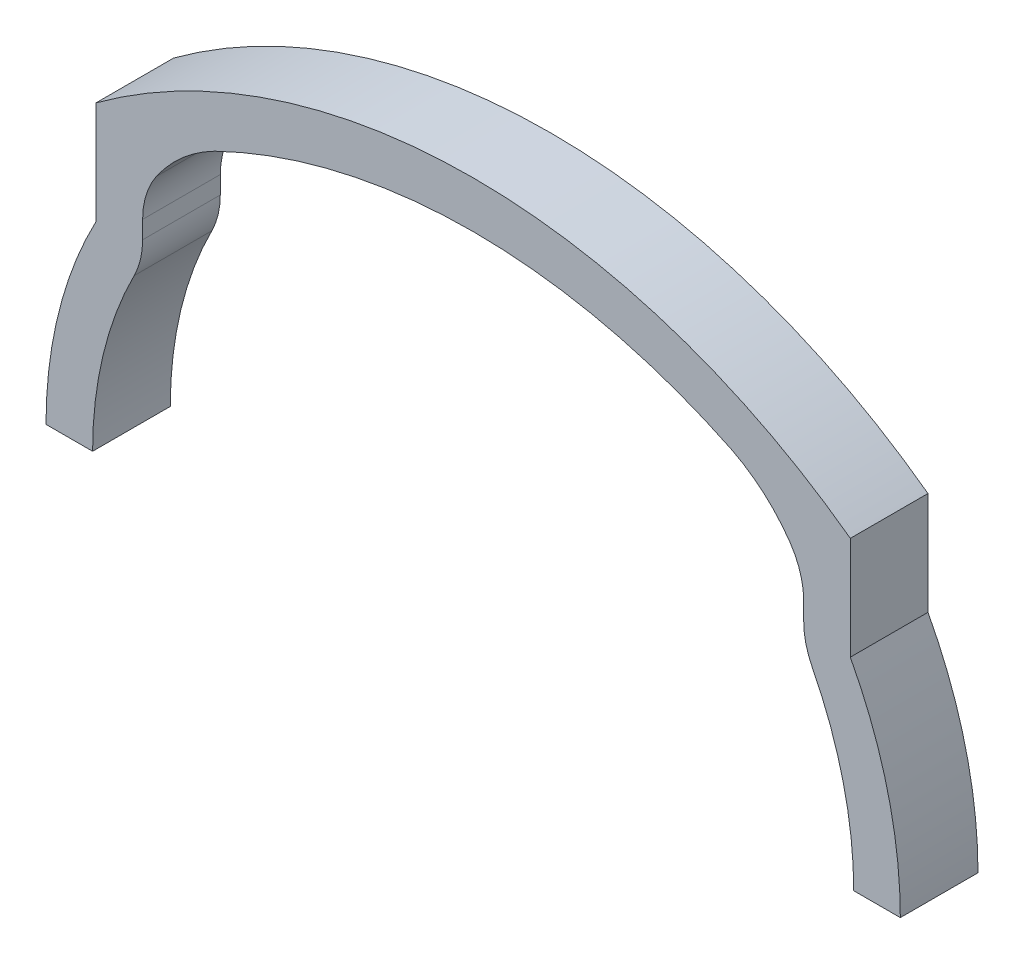
ISO-10303-21;
HEADER;
FILE_DESCRIPTION(('STEP AP214'),'2;1');
FILE_NAME('part.step','',(''),(''),'','','');
FILE_SCHEMA(('AUTOMOTIVE_DESIGN { 1 0 10303 214 1 1 1 1 }'));
ENDSEC;
DATA;
#1=APPLICATION_CONTEXT('core data for automotive mechanical design processes');
#2=APPLICATION_PROTOCOL_DEFINITION('international standard','automotive_design',2000,#1);
#3=PRODUCT_CONTEXT('',#1,'mechanical');
#4=PRODUCT('Part','Part','',(#3));
#5=PRODUCT_RELATED_PRODUCT_CATEGORY('part','',(#4));
#6=PRODUCT_DEFINITION_FORMATION('','',#4);
#7=PRODUCT_DEFINITION_CONTEXT('part definition',#1,'design');
#8=PRODUCT_DEFINITION('design','',#6,#7);
#9=PRODUCT_DEFINITION_SHAPE('','',#8);
#10=(LENGTH_UNIT() NAMED_UNIT(*) SI_UNIT(.MILLI.,.METRE.));
#11=(NAMED_UNIT(*) PLANE_ANGLE_UNIT() SI_UNIT($,.RADIAN.));
#12=(NAMED_UNIT(*) SI_UNIT($,.STERADIAN.) SOLID_ANGLE_UNIT());
#13=UNCERTAINTY_MEASURE_WITH_UNIT(LENGTH_MEASURE(1.E-05),#10,'distance_accuracy_value','');
#14=(GEOMETRIC_REPRESENTATION_CONTEXT(3) GLOBAL_UNCERTAINTY_ASSIGNED_CONTEXT((#13)) GLOBAL_UNIT_ASSIGNED_CONTEXT((#10,
#11,#12)) REPRESENTATION_CONTEXT('',''));
#15=CARTESIAN_POINT('',(0.,0.,0.));
#16=DIRECTION('',(0.,0.,1.));
#17=DIRECTION('',(1.,0.,0.));
#18=AXIS2_PLACEMENT_3D('',#15,#16,#17);
#19=CARTESIAN_POINT('',(-16.28,14.5401270485188,5.));
#20=DIRECTION('',(0.,0.,-1.));
#21=DIRECTION('',(-1.,0.,0.));
#22=AXIS2_PLACEMENT_3D('',#19,#20,#21);
#23=CYLINDRICAL_SURFACE('',#22,5.);
#24=CARTESIAN_POINT('',(-16.28,14.5401270485188,0.));
#25=DIRECTION('',(0.,0.,1.));
#26=DIRECTION('',(1.,0.,0.));
#27=AXIS2_PLACEMENT_3D('',#24,#25,#26);
#28=CIRCLE('',#27,5.);
#29=CARTESIAN_POINT('',(-20.3927555649448,17.3835829850537,0.));
#30=VERTEX_POINT('',#29);
#31=CARTESIAN_POINT('',(-21.28,14.5401270485188,0.));
#32=VERTEX_POINT('',#31);
#33=EDGE_CURVE('E198',#30,#32,#28,.T.);
#34=ORIENTED_EDGE('',*,*,#33,.F.);
#35=DIRECTION('',(0.,0.,-1.));
#36=VECTOR('',#35,1.);
#37=CARTESIAN_POINT('',(-20.3927555649448,17.3835829850537,5.));
#38=LINE('',#37,#36);
#39=CARTESIAN_POINT('',(-20.3927555649448,17.3835829850537,5.));
#40=VERTEX_POINT('',#39);
#41=EDGE_CURVE('E11',#40,#30,#38,.T.);
#42=ORIENTED_EDGE('',*,*,#41,.F.);
#43=CARTESIAN_POINT('',(-16.28,14.5401270485188,5.));
#44=DIRECTION('',(0.,0.,1.));
#45=DIRECTION('',(1.,0.,0.));
#46=AXIS2_PLACEMENT_3D('',#43,#44,#45);
#47=CIRCLE('',#46,5.);
#48=CARTESIAN_POINT('',(-21.28,14.5401270485188,5.));
#49=VERTEX_POINT('',#48);
#50=EDGE_CURVE('E256',#40,#49,#47,.T.);
#51=ORIENTED_EDGE('',*,*,#50,.T.);
#52=DIRECTION('',(0.,0.,-1.));
#53=VECTOR('',#52,1.);
#54=CARTESIAN_POINT('',(-21.28,14.5401270485188,5.));
#55=LINE('',#54,#53);
#56=EDGE_CURVE('E58',#49,#32,#55,.T.);
#57=ORIENTED_EDGE('',*,*,#56,.T.);
#58=EDGE_LOOP('',(#34,#42,#51,#57));
#59=FACE_BOUND('',#58,.T.);
#60=ADVANCED_FACE('F41',(#59),#23,.F.);
#61=CARTESIAN_POINT('',(-12.0318407884017,11.6030564303366,5.));
#62=DIRECTION('',(0.,0.,-1.));
#63=DIRECTION('',(-1.,0.,0.));
#64=AXIS2_PLACEMENT_3D('',#61,#62,#63);
#65=CYLINDRICAL_SURFACE('',#64,10.1646142647129);
#66=CARTESIAN_POINT('',(-12.0318407884017,11.6030564303366,0.));
#67=DIRECTION('',(0.,0.,1.));
#68=DIRECTION('',(1.,0.,0.));
#69=AXIS2_PLACEMENT_3D('',#66,#67,#68);
#70=CIRCLE('',#69,10.1646142647129);
#71=CARTESIAN_POINT('',(-16.6443577408908,20.660874628634,0.));
#72=VERTEX_POINT('',#71);
#73=EDGE_CURVE('E201',#72,#30,#70,.T.);
#74=ORIENTED_EDGE('',*,*,#73,.F.);
#75=DIRECTION('',(0.,0.,-1.));
#76=VECTOR('',#75,1.);
#77=CARTESIAN_POINT('',(-16.6443577408908,20.660874628634,5.));
#78=LINE('',#77,#76);
#79=CARTESIAN_POINT('',(-16.6443577408908,20.660874628634,5.));
#80=VERTEX_POINT('',#79);
#81=EDGE_CURVE('E50',#80,#72,#78,.T.);
#82=ORIENTED_EDGE('',*,*,#81,.F.);
#83=CARTESIAN_POINT('',(-12.0318407884017,11.6030564303366,5.));
#84=DIRECTION('',(0.,0.,1.));
#85=DIRECTION('',(1.,0.,0.));
#86=AXIS2_PLACEMENT_3D('',#83,#84,#85);
#87=CIRCLE('',#86,10.1646142647129);
#88=EDGE_CURVE('E573',#80,#40,#87,.T.);
#89=ORIENTED_EDGE('',*,*,#88,.T.);
#90=ORIENTED_EDGE('',*,*,#41,.T.);
#91=EDGE_LOOP('',(#74,#82,#89,#90));
#92=FACE_BOUND('',#91,.T.);
#93=ADVANCED_FACE('F316',(#92),#65,.F.);
#94=CARTESIAN_POINT('',(0.,-13.5,5.));
#95=DIRECTION('',(0.,0.,-1.));
#96=DIRECTION('',(-1.,0.,0.));
#97=AXIS2_PLACEMENT_3D('',#94,#95,#96);
#98=CYLINDRICAL_SURFACE('',#97,38.);
#99=CARTESIAN_POINT('',(0.,-13.5,0.));
#100=DIRECTION('',(0.,0.,1.));
#101=DIRECTION('',(1.,0.,0.));
#102=AXIS2_PLACEMENT_3D('',#99,#100,#101);
#103=CIRCLE('',#102,38.);
#104=CARTESIAN_POINT('',(16.6443577408908,20.660874628634,0.));
#105=VERTEX_POINT('',#104);
#106=EDGE_CURVE('E205',#105,#72,#103,.T.);
#107=ORIENTED_EDGE('',*,*,#106,.F.);
#108=DIRECTION('',(0.,0.,-1.));
#109=VECTOR('',#108,1.);
#110=CARTESIAN_POINT('',(16.6443577408908,20.660874628634,5.));
#111=LINE('',#110,#109);
#112=CARTESIAN_POINT('',(16.6443577408908,20.660874628634,5.));
#113=VERTEX_POINT('',#112);
#114=EDGE_CURVE('E303',#113,#105,#111,.T.);
#115=ORIENTED_EDGE('',*,*,#114,.F.);
#116=CARTESIAN_POINT('',(0.,-13.5,5.));
#117=DIRECTION('',(0.,0.,1.));
#118=DIRECTION('',(1.,0.,0.));
#119=AXIS2_PLACEMENT_3D('',#116,#117,#118);
#120=CIRCLE('',#119,38.);
#121=EDGE_CURVE('E312',#113,#80,#120,.T.);
#122=ORIENTED_EDGE('',*,*,#121,.T.);
#123=ORIENTED_EDGE('',*,*,#81,.T.);
#124=EDGE_LOOP('',(#107,#115,#122,#123));
#125=FACE_BOUND('',#124,.T.);
#126=ADVANCED_FACE('F310',(#125),#98,.F.);
#127=CARTESIAN_POINT('',(12.0318407884017,11.6030564303366,5.));
#128=DIRECTION('',(0.,0.,-1.));
#129=DIRECTION('',(-1.,0.,0.));
#130=AXIS2_PLACEMENT_3D('',#127,#128,#129);
#131=CYLINDRICAL_SURFACE('',#130,10.1646142647129);
#132=CARTESIAN_POINT('',(12.0318407884017,11.6030564303366,0.));
#133=DIRECTION('',(0.,0.,1.));
#134=DIRECTION('',(1.,0.,0.));
#135=AXIS2_PLACEMENT_3D('',#132,#133,#134);
#136=CIRCLE('',#135,10.1646142647129);
#137=CARTESIAN_POINT('',(20.3927555649448,17.3835829850537,0.));
#138=VERTEX_POINT('',#137);
#139=EDGE_CURVE('E209',#105,#138,#136,.F.);
#140=ORIENTED_EDGE('',*,*,#139,.T.);
#141=DIRECTION('',(0.,0.,-1.));
#142=VECTOR('',#141,1.);
#143=CARTESIAN_POINT('',(20.3927555649448,17.3835829850537,5.));
#144=LINE('',#143,#142);
#145=CARTESIAN_POINT('',(20.3927555649448,17.3835829850537,5.));
#146=VERTEX_POINT('',#145);
#147=EDGE_CURVE('E299',#146,#138,#144,.T.);
#148=ORIENTED_EDGE('',*,*,#147,.F.);
#149=CARTESIAN_POINT('',(12.0318407884017,11.6030564303366,5.));
#150=DIRECTION('',(0.,0.,1.));
#151=DIRECTION('',(1.,0.,0.));
#152=AXIS2_PLACEMENT_3D('',#149,#150,#151);
#153=CIRCLE('',#152,10.1646142647129);
#154=EDGE_CURVE('E334',#113,#146,#153,.F.);
#155=ORIENTED_EDGE('',*,*,#154,.F.);
#156=ORIENTED_EDGE('',*,*,#114,.T.);
#157=EDGE_LOOP('',(#140,#148,#155,#156));
#158=FACE_BOUND('',#157,.T.);
#159=ADVANCED_FACE('F324',(#158),#131,.F.);
#160=CARTESIAN_POINT('',(16.28,14.5401270485188,5.));
#161=DIRECTION('',(0.,0.,-1.));
#162=DIRECTION('',(-1.,0.,0.));
#163=AXIS2_PLACEMENT_3D('',#160,#161,#162);
#164=CYLINDRICAL_SURFACE('',#163,5.);
#165=CARTESIAN_POINT('',(16.28,14.5401270485188,0.));
#166=DIRECTION('',(0.,0.,1.));
#167=DIRECTION('',(1.,0.,0.));
#168=AXIS2_PLACEMENT_3D('',#165,#166,#167);
#169=CIRCLE('',#168,5.);
#170=CARTESIAN_POINT('',(21.28,14.5401270485188,0.));
#171=VERTEX_POINT('',#170);
#172=EDGE_CURVE('E212',#138,#171,#169,.F.);
#173=ORIENTED_EDGE('',*,*,#172,.T.);
#174=DIRECTION('',(0.,0.,-1.));
#175=VECTOR('',#174,1.);
#176=CARTESIAN_POINT('',(21.28,14.5401270485188,5.));
#177=LINE('',#176,#175);
#178=CARTESIAN_POINT('',(21.28,14.5401270485188,5.));
#179=VERTEX_POINT('',#178);
#180=EDGE_CURVE('E295',#179,#171,#177,.T.);
#181=ORIENTED_EDGE('',*,*,#180,.F.);
#182=CARTESIAN_POINT('',(16.28,14.5401270485188,5.));
#183=DIRECTION('',(0.,0.,1.));
#184=DIRECTION('',(1.,0.,0.));
#185=AXIS2_PLACEMENT_3D('',#182,#183,#184);
#186=CIRCLE('',#185,5.);
#187=EDGE_CURVE('E330',#146,#179,#186,.F.);
#188=ORIENTED_EDGE('',*,*,#187,.F.);
#189=ORIENTED_EDGE('',*,*,#147,.T.);
#190=EDGE_LOOP('',(#173,#181,#188,#189));
#191=FACE_BOUND('',#190,.T.);
#192=ADVANCED_FACE('F328',(#191),#164,.F.);
#193=CARTESIAN_POINT('',(21.28,0.,5.));
#194=DIRECTION('',(1.,0.,0.));
#195=DIRECTION('',(0.,0.,-1.));
#196=AXIS2_PLACEMENT_3D('',#193,#194,#195);
#197=PLANE('',#196);
#198=DIRECTION('',(0.,-1.,0.));
#199=VECTOR('',#198,1.);
#200=CARTESIAN_POINT('',(21.28,0.,0.));
#201=LINE('',#200,#199);
#202=CARTESIAN_POINT('',(21.28,13.401925234831,0.));
#203=VERTEX_POINT('',#202);
#204=EDGE_CURVE('E215',#171,#203,#201,.T.);
#205=ORIENTED_EDGE('',*,*,#204,.T.);
#206=DIRECTION('',(0.,0.,-1.));
#207=VECTOR('',#206,1.);
#208=CARTESIAN_POINT('',(21.28,13.401925234831,5.));
#209=LINE('',#208,#207);
#210=CARTESIAN_POINT('',(21.28,13.401925234831,5.));
#211=VERTEX_POINT('',#210);
#212=EDGE_CURVE('E291',#211,#203,#209,.T.);
#213=ORIENTED_EDGE('',*,*,#212,.F.);
#214=DIRECTION('',(0.,-1.,0.));
#215=VECTOR('',#214,1.);
#216=CARTESIAN_POINT('',(21.28,0.,5.));
#217=LINE('',#216,#215);
#218=EDGE_CURVE('E333',#179,#211,#217,.T.);
#219=ORIENTED_EDGE('',*,*,#218,.F.);
#220=ORIENTED_EDGE('',*,*,#180,.T.);
#221=EDGE_LOOP('',(#205,#213,#219,#220));
#222=FACE_BOUND('',#221,.T.);
#223=ADVANCED_FACE('F402',(#222),#197,.F.);
#224=CARTESIAN_POINT('',(26.28,13.401925234831,5.));
#225=DIRECTION('',(0.,0.,-1.));
#226=DIRECTION('',(-1.,0.,0.));
#227=AXIS2_PLACEMENT_3D('',#224,#225,#226);
#228=CYLINDRICAL_SURFACE('',#227,5.);
#229=CARTESIAN_POINT('',(26.28,13.401925234831,0.));
#230=DIRECTION('',(0.,0.,1.));
#231=DIRECTION('',(1.,0.,0.));
#232=AXIS2_PLACEMENT_3D('',#229,#230,#231);
#233=CIRCLE('',#232,5.);
#234=CARTESIAN_POINT('',(21.8257627118644,11.1304124831647,0.));
#235=VERTEX_POINT('',#234);
#236=EDGE_CURVE('E218',#203,#235,#233,.T.);
#237=ORIENTED_EDGE('',*,*,#236,.T.);
#238=DIRECTION('',(0.,0.,-1.));
#239=VECTOR('',#238,1.);
#240=CARTESIAN_POINT('',(21.8257627118644,11.1304124831647,5.));
#241=LINE('',#240,#239);
#242=CARTESIAN_POINT('',(21.8257627118644,11.1304124831647,5.));
#243=VERTEX_POINT('',#242);
#244=EDGE_CURVE('E288',#243,#235,#241,.T.);
#245=ORIENTED_EDGE('',*,*,#244,.F.);
#246=CARTESIAN_POINT('',(26.28,13.401925234831,5.));
#247=DIRECTION('',(0.,0.,1.));
#248=DIRECTION('',(1.,0.,0.));
#249=AXIS2_PLACEMENT_3D('',#246,#247,#248);
#250=CIRCLE('',#249,5.);
#251=EDGE_CURVE('E338',#211,#243,#250,.T.);
#252=ORIENTED_EDGE('',*,*,#251,.F.);
#253=ORIENTED_EDGE('',*,*,#212,.T.);
#254=EDGE_LOOP('',(#237,#245,#252,#253));
#255=FACE_BOUND('',#254,.T.);
#256=ADVANCED_FACE('F405',(#255),#228,.T.);
#257=CARTESIAN_POINT('',(0.,0.,5.));
#258=DIRECTION('',(0.,0.,-1.));
#259=DIRECTION('',(-1.,0.,0.));
#260=AXIS2_PLACEMENT_3D('',#257,#258,#259);
#261=CYLINDRICAL_SURFACE('',#260,24.5);
#262=CARTESIAN_POINT('',(0.,0.,0.));
#263=DIRECTION('',(0.,0.,1.));
#264=DIRECTION('',(1.,0.,0.));
#265=AXIS2_PLACEMENT_3D('',#262,#263,#264);
#266=CIRCLE('',#265,24.5);
#267=CARTESIAN_POINT('',(24.5,0.,0.));
#268=VERTEX_POINT('',#267);
#269=EDGE_CURVE('E222',#268,#235,#266,.T.);
#270=ORIENTED_EDGE('',*,*,#269,.F.);
#271=DIRECTION('',(0.,0.,-1.));
#272=VECTOR('',#271,1.);
#273=CARTESIAN_POINT('',(24.5,0.,5.));
#274=LINE('',#273,#272);
#275=CARTESIAN_POINT('',(24.5,0.,5.));
#276=VERTEX_POINT('',#275);
#277=EDGE_CURVE('E285',#276,#268,#274,.T.);
#278=ORIENTED_EDGE('',*,*,#277,.F.);
#279=CARTESIAN_POINT('',(0.,0.,5.));
#280=DIRECTION('',(0.,0.,1.));
#281=DIRECTION('',(1.,0.,0.));
#282=AXIS2_PLACEMENT_3D('',#279,#280,#281);
#283=CIRCLE('',#282,24.5);
#284=EDGE_CURVE('E345',#276,#243,#283,.T.);
#285=ORIENTED_EDGE('',*,*,#284,.T.);
#286=ORIENTED_EDGE('',*,*,#244,.T.);
#287=EDGE_LOOP('',(#270,#278,#285,#286));
#288=FACE_BOUND('',#287,.T.);
#289=ADVANCED_FACE('F409',(#288),#261,.F.);
#290=CARTESIAN_POINT('',(0.,0.,5.));
#291=DIRECTION('',(0.,1.,0.));
#292=DIRECTION('',(0.,0.,1.));
#293=AXIS2_PLACEMENT_3D('',#290,#291,#292);
#294=PLANE('',#293);
#295=DIRECTION('',(1.,0.,0.));
#296=VECTOR('',#295,1.);
#297=CARTESIAN_POINT('',(0.,0.,0.));
#298=LINE('',#297,#296);
#299=CARTESIAN_POINT('',(27.5,0.,0.));
#300=VERTEX_POINT('',#299);
#301=EDGE_CURVE('E226',#268,#300,#298,.T.);
#302=ORIENTED_EDGE('',*,*,#301,.T.);
#303=DIRECTION('',(0.,0.,-1.));
#304=VECTOR('',#303,1.);
#305=CARTESIAN_POINT('',(27.5,0.,5.));
#306=LINE('',#305,#304);
#307=CARTESIAN_POINT('',(27.5,0.,5.));
#308=VERTEX_POINT('',#307);
#309=EDGE_CURVE('E281',#308,#300,#306,.T.);
#310=ORIENTED_EDGE('',*,*,#309,.F.);
#311=DIRECTION('',(1.,0.,0.));
#312=VECTOR('',#311,1.);
#313=CARTESIAN_POINT('',(0.,0.,5.));
#314=LINE('',#313,#312);
#315=EDGE_CURVE('E349',#276,#308,#314,.T.);
#316=ORIENTED_EDGE('',*,*,#315,.F.);
#317=ORIENTED_EDGE('',*,*,#277,.T.);
#318=EDGE_LOOP('',(#302,#310,#316,#317));
#319=FACE_BOUND('',#318,.T.);
#320=ADVANCED_FACE('F413',(#319),#294,.F.);
#321=CARTESIAN_POINT('',(0.,0.,5.));
#322=DIRECTION('',(0.,0.,-1.));
#323=DIRECTION('',(-1.,0.,0.));
#324=AXIS2_PLACEMENT_3D('',#321,#322,#323);
#325=CYLINDRICAL_SURFACE('',#324,27.5);
#326=CARTESIAN_POINT('',(0.,0.,0.));
#327=DIRECTION('',(0.,0.,1.));
#328=DIRECTION('',(1.,0.,0.));
#329=AXIS2_PLACEMENT_3D('',#326,#327,#328);
#330=CIRCLE('',#329,27.5);
#331=CARTESIAN_POINT('',(24.28,12.9124590996448,0.));
#332=VERTEX_POINT('',#331);
#333=EDGE_CURVE('E229',#300,#332,#330,.T.);
#334=ORIENTED_EDGE('',*,*,#333,.T.);
#335=DIRECTION('',(0.,0.,-1.));
#336=VECTOR('',#335,1.);
#337=CARTESIAN_POINT('',(24.28,12.9124590996448,5.));
#338=LINE('',#337,#336);
#339=CARTESIAN_POINT('',(24.28,12.9124590996448,5.));
#340=VERTEX_POINT('',#339);
#341=EDGE_CURVE('E278',#340,#332,#338,.T.);
#342=ORIENTED_EDGE('',*,*,#341,.F.);
#343=CARTESIAN_POINT('',(0.,0.,5.));
#344=DIRECTION('',(0.,0.,1.));
#345=DIRECTION('',(1.,0.,0.));
#346=AXIS2_PLACEMENT_3D('',#343,#344,#345);
#347=CIRCLE('',#346,27.5);
#348=EDGE_CURVE('E352',#308,#340,#347,.T.);
#349=ORIENTED_EDGE('',*,*,#348,.F.);
#350=ORIENTED_EDGE('',*,*,#309,.T.);
#351=EDGE_LOOP('',(#334,#342,#349,#350));
#352=FACE_BOUND('',#351,.T.);
#353=ADVANCED_FACE('F415',(#352),#325,.T.);
#354=CARTESIAN_POINT('',(24.28,0.,5.));
#355=DIRECTION('',(1.,0.,0.));
#356=DIRECTION('',(0.,1.,0.));
#357=AXIS2_PLACEMENT_3D('',#354,#355,#356);
#358=PLANE('',#357);
#359=DIRECTION('',(0.,-1.,0.));
#360=VECTOR('',#359,1.);
#361=CARTESIAN_POINT('',(24.28,0.,0.));
#362=LINE('',#361,#360);
#363=CARTESIAN_POINT('',(24.28,19.5375786037657,0.));
#364=VERTEX_POINT('',#363);
#365=EDGE_CURVE('E234',#364,#332,#362,.T.);
#366=ORIENTED_EDGE('',*,*,#365,.F.);
#367=DIRECTION('',(0.,0.,-1.));
#368=VECTOR('',#367,1.);
#369=CARTESIAN_POINT('',(24.28,19.5375786037657,5.));
#370=LINE('',#369,#368);
#371=CARTESIAN_POINT('',(24.28,19.5375786037657,5.));
#372=VERTEX_POINT('',#371);
#373=EDGE_CURVE('E275',#372,#364,#370,.T.);
#374=ORIENTED_EDGE('',*,*,#373,.F.);
#375=DIRECTION('',(0.,-1.,0.));
#376=VECTOR('',#375,1.);
#377=CARTESIAN_POINT('',(24.28,0.,5.));
#378=LINE('',#377,#376);
#379=EDGE_CURVE('E355',#372,#340,#378,.T.);
#380=ORIENTED_EDGE('',*,*,#379,.T.);
#381=ORIENTED_EDGE('',*,*,#341,.T.);
#382=EDGE_LOOP('',(#366,#374,#380,#381));
#383=FACE_BOUND('',#382,.T.);
#384=ADVANCED_FACE('F418',(#383),#358,.T.);
#385=CARTESIAN_POINT('',(0.,-13.5,5.));
#386=DIRECTION('',(0.,0.,-1.));
#387=DIRECTION('',(-1.,0.,0.));
#388=AXIS2_PLACEMENT_3D('',#385,#386,#387);
#389=CYLINDRICAL_SURFACE('',#388,41.);
#390=CARTESIAN_POINT('',(0.,-13.5,0.));
#391=DIRECTION('',(0.,0.,1.));
#392=DIRECTION('',(1.,0.,0.));
#393=AXIS2_PLACEMENT_3D('',#390,#391,#392);
#394=CIRCLE('',#393,41.);
#395=CARTESIAN_POINT('',(-24.28,19.5375786037657,0.));
#396=VERTEX_POINT('',#395);
#397=EDGE_CURVE('E238',#364,#396,#394,.T.);
#398=ORIENTED_EDGE('',*,*,#397,.T.);
#399=DIRECTION('',(0.,0.,-1.));
#400=VECTOR('',#399,1.);
#401=CARTESIAN_POINT('',(-24.28,19.5375786037657,5.));
#402=LINE('',#401,#400);
#403=CARTESIAN_POINT('',(-24.28,19.5375786037657,5.));
#404=VERTEX_POINT('',#403);
#405=EDGE_CURVE('E271',#404,#396,#402,.T.);
#406=ORIENTED_EDGE('',*,*,#405,.F.);
#407=CARTESIAN_POINT('',(0.,-13.5,5.));
#408=DIRECTION('',(0.,0.,1.));
#409=DIRECTION('',(1.,0.,0.));
#410=AXIS2_PLACEMENT_3D('',#407,#408,#409);
#411=CIRCLE('',#410,41.);
#412=EDGE_CURVE('E359',#372,#404,#411,.T.);
#413=ORIENTED_EDGE('',*,*,#412,.F.);
#414=ORIENTED_EDGE('',*,*,#373,.T.);
#415=EDGE_LOOP('',(#398,#406,#413,#414));
#416=FACE_BOUND('',#415,.T.);
#417=ADVANCED_FACE('F422',(#416),#389,.T.);
#418=CARTESIAN_POINT('',(-24.28,0.,5.));
#419=DIRECTION('',(1.,0.,0.));
#420=DIRECTION('',(0.,1.,0.));
#421=AXIS2_PLACEMENT_3D('',#418,#419,#420);
#422=PLANE('',#421);
#423=DIRECTION('',(0.,-1.,0.));
#424=VECTOR('',#423,1.);
#425=CARTESIAN_POINT('',(-24.28,0.,0.));
#426=LINE('',#425,#424);
#427=CARTESIAN_POINT('',(-24.28,12.9124590996448,0.));
#428=VERTEX_POINT('',#427);
#429=EDGE_CURVE('E241',#396,#428,#426,.T.);
#430=ORIENTED_EDGE('',*,*,#429,.T.);
#431=DIRECTION('',(0.,0.,-1.));
#432=VECTOR('',#431,1.);
#433=CARTESIAN_POINT('',(-24.28,12.9124590996448,5.));
#434=LINE('',#433,#432);
#435=CARTESIAN_POINT('',(-24.28,12.9124590996448,5.));
#436=VERTEX_POINT('',#435);
#437=EDGE_CURVE('E267',#436,#428,#434,.T.);
#438=ORIENTED_EDGE('',*,*,#437,.F.);
#439=DIRECTION('',(0.,-1.,0.));
#440=VECTOR('',#439,1.);
#441=CARTESIAN_POINT('',(-24.28,0.,5.));
#442=LINE('',#441,#440);
#443=EDGE_CURVE('E362',#404,#436,#442,.T.);
#444=ORIENTED_EDGE('',*,*,#443,.F.);
#445=ORIENTED_EDGE('',*,*,#405,.T.);
#446=EDGE_LOOP('',(#430,#438,#444,#445));
#447=FACE_BOUND('',#446,.T.);
#448=ADVANCED_FACE('F426',(#447),#422,.F.);
#449=CARTESIAN_POINT('',(0.,0.,5.));
#450=DIRECTION('',(0.,0.,-1.));
#451=DIRECTION('',(-1.,0.,0.));
#452=AXIS2_PLACEMENT_3D('',#449,#450,#451);
#453=CYLINDRICAL_SURFACE('',#452,27.5);
#454=CARTESIAN_POINT('',(0.,0.,0.));
#455=DIRECTION('',(0.,0.,1.));
#456=DIRECTION('',(1.,0.,0.));
#457=AXIS2_PLACEMENT_3D('',#454,#455,#456);
#458=CIRCLE('',#457,27.5);
#459=CARTESIAN_POINT('',(-27.5,0.,0.));
#460=VERTEX_POINT('',#459);
#461=EDGE_CURVE('E244',#428,#460,#458,.T.);
#462=ORIENTED_EDGE('',*,*,#461,.T.);
#463=DIRECTION('',(0.,0.,-1.));
#464=VECTOR('',#463,1.);
#465=CARTESIAN_POINT('',(-27.5,0.,5.));
#466=LINE('',#465,#464);
#467=CARTESIAN_POINT('',(-27.5,0.,5.));
#468=VERTEX_POINT('',#467);
#469=EDGE_CURVE('E263',#468,#460,#466,.T.);
#470=ORIENTED_EDGE('',*,*,#469,.F.);
#471=CARTESIAN_POINT('',(0.,0.,5.));
#472=DIRECTION('',(0.,0.,1.));
#473=DIRECTION('',(1.,0.,0.));
#474=AXIS2_PLACEMENT_3D('',#471,#472,#473);
#475=CIRCLE('',#474,27.5);
#476=EDGE_CURVE('E364',#436,#468,#475,.T.);
#477=ORIENTED_EDGE('',*,*,#476,.F.);
#478=ORIENTED_EDGE('',*,*,#437,.T.);
#479=EDGE_LOOP('',(#462,#470,#477,#478));
#480=FACE_BOUND('',#479,.T.);
#481=ADVANCED_FACE('F372',(#480),#453,.T.);
#482=CARTESIAN_POINT('',(-24.5,0.,0.));
#483=VERTEX_POINT('',#482);
#484=EDGE_CURVE('E230',#460,#483,#298,.T.);
#485=ORIENTED_EDGE('',*,*,#484,.T.);
#486=DIRECTION('',(0.,0.,-1.));
#487=VECTOR('',#486,1.);
#488=CARTESIAN_POINT('',(-24.5,0.,5.));
#489=LINE('',#488,#487);
#490=CARTESIAN_POINT('',(-24.5,0.,5.));
#491=VERTEX_POINT('',#490);
#492=EDGE_CURVE('E178',#491,#483,#489,.T.);
#493=ORIENTED_EDGE('',*,*,#492,.F.);
#494=EDGE_CURVE('E186',#468,#491,#314,.T.);
#495=ORIENTED_EDGE('',*,*,#494,.F.);
#496=ORIENTED_EDGE('',*,*,#469,.T.);
#497=EDGE_LOOP('',(#485,#493,#495,#496));
#498=FACE_BOUND('',#497,.T.);
#499=ADVANCED_FACE('F377',(#498),#294,.F.);
#500=CARTESIAN_POINT('',(0.,0.,5.));
#501=DIRECTION('',(0.,0.,-1.));
#502=DIRECTION('',(-1.,0.,0.));
#503=AXIS2_PLACEMENT_3D('',#500,#501,#502);
#504=CYLINDRICAL_SURFACE('',#503,24.5);
#505=CARTESIAN_POINT('',(0.,0.,0.));
#506=DIRECTION('',(0.,0.,1.));
#507=DIRECTION('',(1.,0.,0.));
#508=AXIS2_PLACEMENT_3D('',#505,#506,#507);
#509=CIRCLE('',#508,24.5);
#510=CARTESIAN_POINT('',(-21.8257627118644,11.1304124831647,0.));
#511=VERTEX_POINT('',#510);
#512=EDGE_CURVE('E173',#511,#483,#509,.T.);
#513=ORIENTED_EDGE('',*,*,#512,.F.);
#514=DIRECTION('',(0.,0.,-1.));
#515=VECTOR('',#514,1.);
#516=CARTESIAN_POINT('',(-21.8257627118644,11.1304124831647,5.));
#517=LINE('',#516,#515);
#518=CARTESIAN_POINT('',(-21.8257627118644,11.1304124831647,5.));
#519=VERTEX_POINT('',#518);
#520=EDGE_CURVE('E168',#519,#511,#517,.T.);
#521=ORIENTED_EDGE('',*,*,#520,.F.);
#522=CARTESIAN_POINT('',(0.,0.,5.));
#523=DIRECTION('',(0.,0.,1.));
#524=DIRECTION('',(1.,0.,0.));
#525=AXIS2_PLACEMENT_3D('',#522,#523,#524);
#526=CIRCLE('',#525,24.5);
#527=EDGE_CURVE('E171',#519,#491,#526,.T.);
#528=ORIENTED_EDGE('',*,*,#527,.T.);
#529=ORIENTED_EDGE('',*,*,#492,.T.);
#530=EDGE_LOOP('',(#513,#521,#528,#529));
#531=FACE_BOUND('',#530,.T.);
#532=ADVANCED_FACE('F170',(#531),#504,.F.);
#533=CARTESIAN_POINT('',(-26.28,13.401925234831,5.));
#534=DIRECTION('',(0.,0.,-1.));
#535=DIRECTION('',(-1.,0.,0.));
#536=AXIS2_PLACEMENT_3D('',#533,#534,#535);
#537=CYLINDRICAL_SURFACE('',#536,5.);
#538=CARTESIAN_POINT('',(-26.28,13.401925234831,0.));
#539=DIRECTION('',(0.,0.,1.));
#540=DIRECTION('',(1.,0.,0.));
#541=AXIS2_PLACEMENT_3D('',#538,#539,#540);
#542=CIRCLE('',#541,5.);
#543=CARTESIAN_POINT('',(-21.28,13.401925234831,0.));
#544=VERTEX_POINT('',#543);
#545=EDGE_CURVE('E249',#544,#511,#542,.F.);
#546=ORIENTED_EDGE('',*,*,#545,.F.);
#547=DIRECTION('',(0.,0.,-1.));
#548=VECTOR('',#547,1.);
#549=CARTESIAN_POINT('',(-21.28,13.401925234831,5.));
#550=LINE('',#549,#548);
#551=CARTESIAN_POINT('',(-21.28,13.401925234831,5.));
#552=VERTEX_POINT('',#551);
#553=EDGE_CURVE('E113',#552,#544,#550,.T.);
#554=ORIENTED_EDGE('',*,*,#553,.F.);
#555=CARTESIAN_POINT('',(-26.28,13.401925234831,5.));
#556=DIRECTION('',(0.,0.,1.));
#557=DIRECTION('',(1.,0.,0.));
#558=AXIS2_PLACEMENT_3D('',#555,#556,#557);
#559=CIRCLE('',#558,5.);
#560=EDGE_CURVE('E184',#552,#519,#559,.F.);
#561=ORIENTED_EDGE('',*,*,#560,.T.);
#562=ORIENTED_EDGE('',*,*,#520,.T.);
#563=EDGE_LOOP('',(#546,#554,#561,#562));
#564=FACE_BOUND('',#563,.T.);
#565=ADVANCED_FACE('F190',(#564),#537,.T.);
#566=CARTESIAN_POINT('',(-21.28,0.,5.));
#567=DIRECTION('',(1.,0.,0.));
#568=DIRECTION('',(0.,0.,-1.));
#569=AXIS2_PLACEMENT_3D('',#566,#567,#568);
#570=PLANE('',#569);
#571=DIRECTION('',(0.,-1.,0.));
#572=VECTOR('',#571,1.);
#573=CARTESIAN_POINT('',(-21.28,0.,0.));
#574=LINE('',#573,#572);
#575=EDGE_CURVE('E252',#32,#544,#574,.T.);
#576=ORIENTED_EDGE('',*,*,#575,.F.);
#577=ORIENTED_EDGE('',*,*,#56,.F.);
#578=DIRECTION('',(0.,-1.,0.));
#579=VECTOR('',#578,1.);
#580=CARTESIAN_POINT('',(-21.28,0.,5.));
#581=LINE('',#580,#579);
#582=EDGE_CURVE('E192',#49,#552,#581,.T.);
#583=ORIENTED_EDGE('',*,*,#582,.T.);
#584=ORIENTED_EDGE('',*,*,#553,.T.);
#585=EDGE_LOOP('',(#576,#577,#583,#584));
#586=FACE_BOUND('',#585,.T.);
#587=ADVANCED_FACE('F379',(#586),#570,.T.);
#588=CARTESIAN_POINT('',(0.,0.,5.));
#589=DIRECTION('',(0.,0.,1.));
#590=DIRECTION('',(1.,0.,0.));
#591=AXIS2_PLACEMENT_3D('',#588,#589,#590);
#592=PLANE('',#591);
#593=ORIENTED_EDGE('',*,*,#50,.F.);
#594=ORIENTED_EDGE('',*,*,#88,.F.);
#595=ORIENTED_EDGE('',*,*,#121,.F.);
#596=ORIENTED_EDGE('',*,*,#154,.T.);
#597=ORIENTED_EDGE('',*,*,#187,.T.);
#598=ORIENTED_EDGE('',*,*,#218,.T.);
#599=ORIENTED_EDGE('',*,*,#251,.T.);
#600=ORIENTED_EDGE('',*,*,#284,.F.);
#601=ORIENTED_EDGE('',*,*,#315,.T.);
#602=ORIENTED_EDGE('',*,*,#348,.T.);
#603=ORIENTED_EDGE('',*,*,#379,.F.);
#604=ORIENTED_EDGE('',*,*,#412,.T.);
#605=ORIENTED_EDGE('',*,*,#443,.T.);
#606=ORIENTED_EDGE('',*,*,#476,.T.);
#607=ORIENTED_EDGE('',*,*,#494,.T.);
#608=ORIENTED_EDGE('',*,*,#527,.F.);
#609=ORIENTED_EDGE('',*,*,#560,.F.);
#610=ORIENTED_EDGE('',*,*,#582,.F.);
#611=EDGE_LOOP('',(#593,#594,#595,#596,#597,#598,#599,#600,#601,#602,#603,#604,#605,#606,#607,
#608,#609,#610));
#612=FACE_BOUND('',#611,.T.);
#613=ADVANCED_FACE('F182',(#612),#592,.T.);
#614=CARTESIAN_POINT('',(0.,0.,0.));
#615=DIRECTION('',(0.,0.,1.));
#616=DIRECTION('',(1.,0.,0.));
#617=AXIS2_PLACEMENT_3D('',#614,#615,#616);
#618=PLANE('',#617);
#619=ORIENTED_EDGE('',*,*,#33,.T.);
#620=ORIENTED_EDGE('',*,*,#575,.T.);
#621=ORIENTED_EDGE('',*,*,#545,.T.);
#622=ORIENTED_EDGE('',*,*,#512,.T.);
#623=ORIENTED_EDGE('',*,*,#484,.F.);
#624=ORIENTED_EDGE('',*,*,#461,.F.);
#625=ORIENTED_EDGE('',*,*,#429,.F.);
#626=ORIENTED_EDGE('',*,*,#397,.F.);
#627=ORIENTED_EDGE('',*,*,#365,.T.);
#628=ORIENTED_EDGE('',*,*,#333,.F.);
#629=ORIENTED_EDGE('',*,*,#301,.F.);
#630=ORIENTED_EDGE('',*,*,#269,.T.);
#631=ORIENTED_EDGE('',*,*,#236,.F.);
#632=ORIENTED_EDGE('',*,*,#204,.F.);
#633=ORIENTED_EDGE('',*,*,#172,.F.);
#634=ORIENTED_EDGE('',*,*,#139,.F.);
#635=ORIENTED_EDGE('',*,*,#106,.T.);
#636=ORIENTED_EDGE('',*,*,#73,.T.);
#637=EDGE_LOOP('',(#619,#620,#621,#622,#623,#624,#625,#626,#627,#628,#629,#630,#631,#632,#633,
#634,#635,#636));
#638=FACE_BOUND('',#637,.T.);
#639=ADVANCED_FACE('F319',(#638),#618,.F.);
#640=CLOSED_SHELL('',(#60,#93,#126,#159,#192,#223,#256,#289,#320,#353,#384,#417,#448,#481,#499,
#532,#565,#587,#613,#639));
#641=MANIFOLD_SOLID_BREP('B2',#640);
#642=ADVANCED_BREP_SHAPE_REPRESENTATION('',(#18,#641),#14);
#643=SHAPE_DEFINITION_REPRESENTATION(#9,#642);
ENDSEC;
END-ISO-10303-21;
